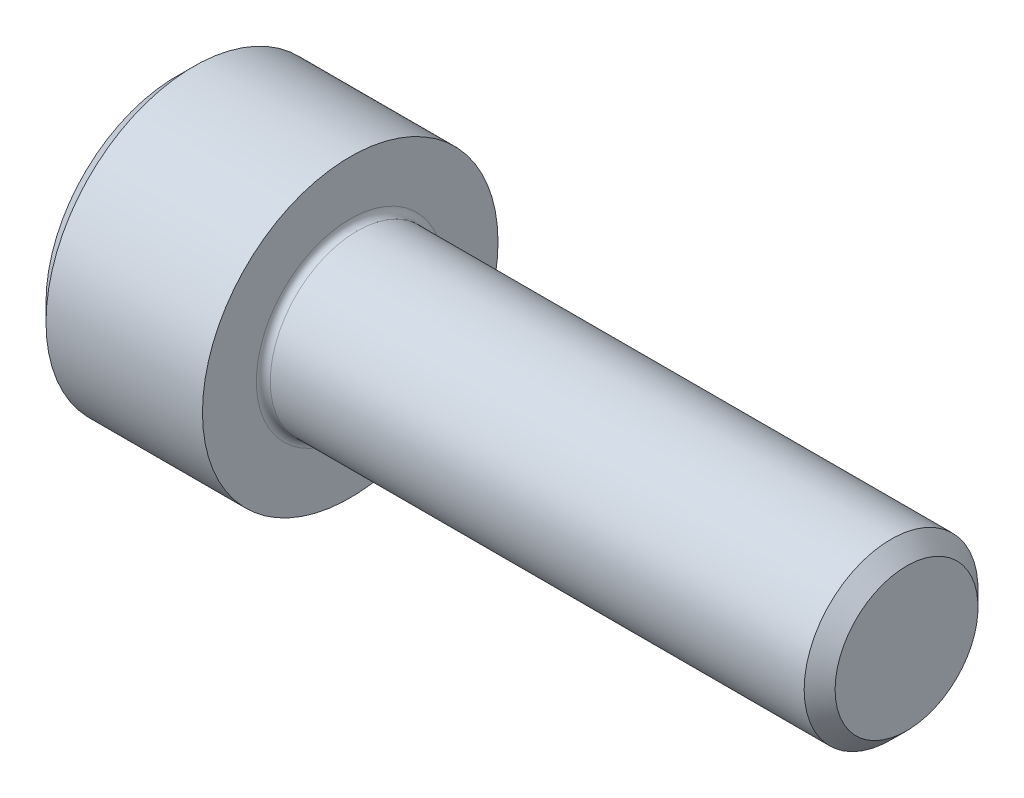
ISO-10303-21;
HEADER;
FILE_DESCRIPTION(('STEP AP214'),'2;1');
FILE_NAME('part.step','',(''),(''),'','','');
FILE_SCHEMA(('AUTOMOTIVE_DESIGN { 1 0 10303 214 1 1 1 1 }'));
ENDSEC;
DATA;
#1=APPLICATION_CONTEXT('core data for automotive mechanical design processes');
#2=APPLICATION_PROTOCOL_DEFINITION('international standard','automotive_design',2000,#1);
#3=PRODUCT_CONTEXT('',#1,'mechanical');
#4=PRODUCT('Part','Part','',(#3));
#5=PRODUCT_RELATED_PRODUCT_CATEGORY('part','',(#4));
#6=PRODUCT_DEFINITION_FORMATION('','',#4);
#7=PRODUCT_DEFINITION_CONTEXT('part definition',#1,'design');
#8=PRODUCT_DEFINITION('design','',#6,#7);
#9=PRODUCT_DEFINITION_SHAPE('','',#8);
#10=(LENGTH_UNIT() NAMED_UNIT(*) SI_UNIT(.MILLI.,.METRE.));
#11=(NAMED_UNIT(*) PLANE_ANGLE_UNIT() SI_UNIT($,.RADIAN.));
#12=(NAMED_UNIT(*) SI_UNIT($,.STERADIAN.) SOLID_ANGLE_UNIT());
#13=UNCERTAINTY_MEASURE_WITH_UNIT(LENGTH_MEASURE(1.E-05),#10,'distance_accuracy_value','');
#14=(GEOMETRIC_REPRESENTATION_CONTEXT(3) GLOBAL_UNCERTAINTY_ASSIGNED_CONTEXT((#13)) GLOBAL_UNIT_ASSIGNED_CONTEXT((#10,
#11,#12)) REPRESENTATION_CONTEXT('',''));
#15=CARTESIAN_POINT('',(0.,0.,0.));
#16=DIRECTION('',(0.,0.,1.));
#17=DIRECTION('',(1.,0.,0.));
#18=AXIS2_PLACEMENT_3D('',#15,#16,#17);
#19=CARTESIAN_POINT('',(0.,0.,0.));
#20=DIRECTION('',(-1.,0.,0.));
#21=DIRECTION('',(0.,0.,1.));
#22=AXIS2_PLACEMENT_3D('',#19,#20,#21);
#23=PLANE('',#22);
#24=DIRECTION('',(0.,-0.5,0.866025403784438));
#25=VECTOR('',#24,1.);
#26=CARTESIAN_POINT('',(0.,2.35789849937043,0.));
#27=LINE('',#26,#25);
#28=CARTESIAN_POINT('',(0.,2.35789849937043,0.));
#29=VERTEX_POINT('',#28);
#30=CARTESIAN_POINT('',(0.,1.17894924968521,2.042));
#31=VERTEX_POINT('',#30);
#32=EDGE_CURVE('E386',#29,#31,#27,.T.);
#33=ORIENTED_EDGE('',*,*,#32,.T.);
#34=DIRECTION('',(0.,1.,0.));
#35=VECTOR('',#34,1.);
#36=CARTESIAN_POINT('',(0.,-1.17894924968522,2.042));
#37=LINE('',#36,#35);
#38=CARTESIAN_POINT('',(0.,-1.17894924968522,2.042));
#39=VERTEX_POINT('',#38);
#40=EDGE_CURVE('E130',#39,#31,#37,.T.);
#41=ORIENTED_EDGE('',*,*,#40,.F.);
#42=DIRECTION('',(0.,-0.500000000000001,-0.866025403784438));
#43=VECTOR('',#42,1.);
#44=CARTESIAN_POINT('',(0.,-1.17894924968522,2.042));
#45=LINE('',#44,#43);
#46=CARTESIAN_POINT('',(0.,-2.35789849937044,0.));
#47=VERTEX_POINT('',#46);
#48=EDGE_CURVE('E389',#39,#47,#45,.T.);
#49=ORIENTED_EDGE('',*,*,#48,.T.);
#50=DIRECTION('',(0.,0.5,-0.866025403784439));
#51=VECTOR('',#50,1.);
#52=CARTESIAN_POINT('',(0.,-2.35789849937044,0.));
#53=LINE('',#52,#51);
#54=CARTESIAN_POINT('',(0.,-1.17894924968522,-2.042));
#55=VERTEX_POINT('',#54);
#56=EDGE_CURVE('E392',#47,#55,#53,.T.);
#57=ORIENTED_EDGE('',*,*,#56,.T.);
#58=DIRECTION('',(0.,-1.,0.));
#59=VECTOR('',#58,1.);
#60=CARTESIAN_POINT('',(0.,1.17894924968521,-2.042));
#61=LINE('',#60,#59);
#62=CARTESIAN_POINT('',(0.,1.17894924968521,-2.042));
#63=VERTEX_POINT('',#62);
#64=EDGE_CURVE('E395',#63,#55,#61,.T.);
#65=ORIENTED_EDGE('',*,*,#64,.F.);
#66=DIRECTION('',(0.,-0.500000000000001,-0.866025403784438));
#67=VECTOR('',#66,1.);
#68=CARTESIAN_POINT('',(0.,2.35789849937043,0.));
#69=LINE('',#68,#67);
#70=EDGE_CURVE('E125',#29,#63,#69,.T.);
#71=ORIENTED_EDGE('',*,*,#70,.F.);
#72=EDGE_LOOP('',(#33,#41,#49,#57,#65,#71));
#73=FACE_BOUND('',#72,.T.);
#74=CARTESIAN_POINT('',(0.,0.,0.));
#75=DIRECTION('',(-1.,0.,0.));
#76=DIRECTION('',(0.,0.,1.));
#77=AXIS2_PLACEMENT_3D('',#74,#75,#76);
#78=CIRCLE('',#77,3.75);
#79=CARTESIAN_POINT('',(0.,0.,3.75));
#80=VERTEX_POINT('',#79);
#81=EDGE_CURVE('E141',#80,#80,#78,.T.);
#82=ORIENTED_EDGE('',*,*,#81,.T.);
#83=EDGE_LOOP('',(#82));
#84=FACE_BOUND('',#83,.T.);
#85=ADVANCED_FACE('F34',(#73,#84),#23,.T.);
#86=CARTESIAN_POINT('',(21.,2.055,0.));
#87=DIRECTION('',(1.,0.,0.));
#88=DIRECTION('',(0.,0.,-1.));
#89=AXIS2_PLACEMENT_3D('',#86,#87,#88);
#90=PLANE('',#89);
#91=CARTESIAN_POINT('',(21.,0.,0.));
#92=DIRECTION('',(-1.,0.,0.));
#93=DIRECTION('',(0.,0.,1.));
#94=AXIS2_PLACEMENT_3D('',#91,#92,#93);
#95=CIRCLE('',#94,2.055);
#96=CARTESIAN_POINT('',(21.,0.,2.055));
#97=VERTEX_POINT('',#96);
#98=EDGE_CURVE('E154',#97,#97,#95,.T.);
#99=ORIENTED_EDGE('',*,*,#98,.F.);
#100=EDGE_LOOP('',(#99));
#101=FACE_BOUND('',#100,.T.);
#102=ADVANCED_FACE('F175',(#101),#90,.T.);
#103=CARTESIAN_POINT('',(21.,0.,0.));
#104=DIRECTION('',(-1.,0.,0.));
#105=DIRECTION('',(0.,0.,1.));
#106=AXIS2_PLACEMENT_3D('',#103,#104,#105);
#107=CONICAL_SURFACE('',#106,2.055,0.785398163397382);
#108=CARTESIAN_POINT('',(20.555,0.,0.));
#109=DIRECTION('',(-1.,0.,0.));
#110=DIRECTION('',(0.,0.,1.));
#111=AXIS2_PLACEMENT_3D('',#108,#109,#110);
#112=CIRCLE('',#111,2.49999999999996);
#113=CARTESIAN_POINT('',(20.555,0.,2.49999999999996));
#114=VERTEX_POINT('',#113);
#115=EDGE_CURVE('E151',#114,#114,#112,.T.);
#116=ORIENTED_EDGE('',*,*,#115,.F.);
#117=EDGE_LOOP('',(#116));
#118=FACE_BOUND('',#117,.T.);
#119=ORIENTED_EDGE('',*,*,#98,.T.);
#120=EDGE_LOOP('',(#119));
#121=FACE_BOUND('',#120,.T.);
#122=ADVANCED_FACE('F181',(#118,#121),#107,.T.);
#123=CARTESIAN_POINT('',(-31.75,0.,0.));
#124=DIRECTION('',(-1.,0.,0.));
#125=DIRECTION('',(0.,0.,1.));
#126=AXIS2_PLACEMENT_3D('',#123,#124,#125);
#127=CYLINDRICAL_SURFACE('',#126,2.49999999999998);
#128=CARTESIAN_POINT('',(5.2,0.,0.));
#129=DIRECTION('',(1.,0.,0.));
#130=DIRECTION('',(0.,0.,-1.));
#131=AXIS2_PLACEMENT_3D('',#128,#129,#130);
#132=CIRCLE('',#131,2.49999999999998);
#133=CARTESIAN_POINT('',(5.2,0.,-2.49999999999998));
#134=VERTEX_POINT('',#133);
#135=EDGE_CURVE('E11',#134,#134,#132,.T.);
#136=ORIENTED_EDGE('',*,*,#135,.T.);
#137=EDGE_LOOP('',(#136));
#138=FACE_BOUND('',#137,.T.);
#139=ORIENTED_EDGE('',*,*,#115,.T.);
#140=EDGE_LOOP('',(#139));
#141=FACE_BOUND('',#140,.T.);
#142=ADVANCED_FACE('F192',(#138,#141),#127,.T.);
#143=CARTESIAN_POINT('',(5.,4.25,0.));
#144=DIRECTION('',(1.,0.,0.));
#145=DIRECTION('',(0.,0.,-1.));
#146=AXIS2_PLACEMENT_3D('',#143,#144,#145);
#147=PLANE('',#146);
#148=CARTESIAN_POINT('',(5.,0.,0.));
#149=DIRECTION('',(1.,0.,0.));
#150=DIRECTION('',(0.,0.,-1.));
#151=AXIS2_PLACEMENT_3D('',#148,#149,#150);
#152=CIRCLE('',#151,2.69999999999998);
#153=CARTESIAN_POINT('',(5.,0.,-2.69999999999998));
#154=VERTEX_POINT('',#153);
#155=EDGE_CURVE('E42',#154,#154,#152,.F.);
#156=ORIENTED_EDGE('',*,*,#155,.T.);
#157=EDGE_LOOP('',(#156));
#158=FACE_BOUND('',#157,.T.);
#159=CARTESIAN_POINT('',(5.,0.,0.));
#160=DIRECTION('',(-1.,0.,0.));
#161=DIRECTION('',(0.,0.,1.));
#162=AXIS2_PLACEMENT_3D('',#159,#160,#161);
#163=CIRCLE('',#162,4.25);
#164=CARTESIAN_POINT('',(5.,0.,4.25));
#165=VERTEX_POINT('',#164);
#166=EDGE_CURVE('E148',#165,#165,#163,.T.);
#167=ORIENTED_EDGE('',*,*,#166,.F.);
#168=EDGE_LOOP('',(#167));
#169=FACE_BOUND('',#168,.T.);
#170=ADVANCED_FACE('F159',(#158,#169),#147,.T.);
#171=CARTESIAN_POINT('',(-31.75,0.,0.));
#172=DIRECTION('',(-1.,0.,0.));
#173=DIRECTION('',(0.,0.,1.));
#174=AXIS2_PLACEMENT_3D('',#171,#172,#173);
#175=CYLINDRICAL_SURFACE('',#174,4.25);
#176=ORIENTED_EDGE('',*,*,#166,.T.);
#177=EDGE_LOOP('',(#176));
#178=FACE_BOUND('',#177,.T.);
#179=CARTESIAN_POINT('',(0.5,0.,0.));
#180=DIRECTION('',(-1.,0.,0.));
#181=DIRECTION('',(0.,0.,1.));
#182=AXIS2_PLACEMENT_3D('',#179,#180,#181);
#183=CIRCLE('',#182,4.25);
#184=CARTESIAN_POINT('',(0.5,0.,4.25));
#185=VERTEX_POINT('',#184);
#186=EDGE_CURVE('E145',#185,#185,#183,.T.);
#187=ORIENTED_EDGE('',*,*,#186,.F.);
#188=EDGE_LOOP('',(#187));
#189=FACE_BOUND('',#188,.T.);
#190=ADVANCED_FACE('F170',(#178,#189),#175,.T.);
#191=CARTESIAN_POINT('',(0.,0.,0.));
#192=DIRECTION('',(1.,0.,0.));
#193=DIRECTION('',(0.,0.,-1.));
#194=AXIS2_PLACEMENT_3D('',#191,#192,#193);
#195=CONICAL_SURFACE('',#194,3.75,0.785398163397449);
#196=ORIENTED_EDGE('',*,*,#186,.T.);
#197=EDGE_LOOP('',(#196));
#198=FACE_BOUND('',#197,.T.);
#199=ORIENTED_EDGE('',*,*,#81,.F.);
#200=EDGE_LOOP('',(#199));
#201=FACE_BOUND('',#200,.T.);
#202=ADVANCED_FACE('F163',(#198,#201),#195,.T.);
#203=CARTESIAN_POINT('',(5.2,0.,0.));
#204=DIRECTION('',(1.,0.,0.));
#205=DIRECTION('',(0.,0.,-1.));
#206=AXIS2_PLACEMENT_3D('',#203,#204,#205);
#207=TOROIDAL_SURFACE('',#206,2.69999999999998,0.2);
#208=ORIENTED_EDGE('',*,*,#135,.F.);
#209=EDGE_LOOP('',(#208));
#210=FACE_BOUND('',#209,.T.);
#211=ORIENTED_EDGE('',*,*,#155,.F.);
#212=EDGE_LOOP('',(#211));
#213=FACE_BOUND('',#212,.T.);
#214=ADVANCED_FACE('F36',(#210,#213),#207,.F.);
#215=CARTESIAN_POINT('',(2.5,2.35789849937043,0.));
#216=DIRECTION('',(0.,-0.866025403784439,-0.5));
#217=DIRECTION('',(0.,0.5,-0.866025403784439));
#218=AXIS2_PLACEMENT_3D('',#215,#216,#217);
#219=PLANE('',#218);
#220=ORIENTED_EDGE('',*,*,#32,.F.);
#221=DIRECTION('',(-1.,0.,0.));
#222=VECTOR('',#221,1.);
#223=CARTESIAN_POINT('',(2.5,2.35789849937043,0.));
#224=LINE('',#223,#222);
#225=CARTESIAN_POINT('',(2.5,2.35789849937043,0.));
#226=VERTEX_POINT('',#225);
#227=EDGE_CURVE('E376',#226,#29,#224,.T.);
#228=ORIENTED_EDGE('',*,*,#227,.F.);
#229=DIRECTION('',(0.,-0.5,0.866025403784438));
#230=VECTOR('',#229,1.);
#231=CARTESIAN_POINT('',(2.5,2.35789849937043,0.));
#232=LINE('',#231,#230);
#233=CARTESIAN_POINT('',(2.5,1.76842387452782,1.021));
#234=VERTEX_POINT('',#233);
#235=EDGE_CURVE('E117',#226,#234,#232,.T.);
#236=ORIENTED_EDGE('',*,*,#235,.T.);
#237=CARTESIAN_POINT('',(2.5,1.17894924968521,2.042));
#238=VERTEX_POINT('',#237);
#239=EDGE_CURVE('E108',#234,#238,#232,.T.);
#240=ORIENTED_EDGE('',*,*,#239,.T.);
#241=DIRECTION('',(-1.,0.,0.));
#242=VECTOR('',#241,1.);
#243=CARTESIAN_POINT('',(2.5,1.17894924968521,2.042));
#244=LINE('',#243,#242);
#245=EDGE_CURVE('E122',#238,#31,#244,.T.);
#246=ORIENTED_EDGE('',*,*,#245,.T.);
#247=EDGE_LOOP('',(#220,#228,#236,#240,#246));
#248=FACE_BOUND('',#247,.T.);
#249=ADVANCED_FACE('F121',(#248),#219,.T.);
#250=CARTESIAN_POINT('',(2.5,-1.17894924968522,2.042));
#251=DIRECTION('',(0.,0.,1.));
#252=DIRECTION('',(0.,-1.,0.));
#253=AXIS2_PLACEMENT_3D('',#250,#251,#252);
#254=PLANE('',#253);
#255=ORIENTED_EDGE('',*,*,#40,.T.);
#256=ORIENTED_EDGE('',*,*,#245,.F.);
#257=DIRECTION('',(0.,1.,0.));
#258=VECTOR('',#257,1.);
#259=CARTESIAN_POINT('',(2.5,-1.17894924968522,2.042));
#260=LINE('',#259,#258);
#261=CARTESIAN_POINT('',(2.5,0.,2.042));
#262=VERTEX_POINT('',#261);
#263=EDGE_CURVE('E105',#262,#238,#260,.T.);
#264=ORIENTED_EDGE('',*,*,#263,.F.);
#265=CARTESIAN_POINT('',(2.5,-1.17894924968522,2.042));
#266=VERTEX_POINT('',#265);
#267=EDGE_CURVE('E116',#266,#262,#260,.T.);
#268=ORIENTED_EDGE('',*,*,#267,.F.);
#269=DIRECTION('',(-1.,0.,0.));
#270=VECTOR('',#269,1.);
#271=CARTESIAN_POINT('',(2.5,-1.17894924968522,2.042));
#272=LINE('',#271,#270);
#273=EDGE_CURVE('E132',#266,#39,#272,.T.);
#274=ORIENTED_EDGE('',*,*,#273,.T.);
#275=EDGE_LOOP('',(#255,#256,#264,#268,#274));
#276=FACE_BOUND('',#275,.T.);
#277=ADVANCED_FACE('F127',(#276),#254,.F.);
#278=CARTESIAN_POINT('',(2.5,-1.17894924968522,2.042));
#279=DIRECTION('',(0.,0.866025403784438,-0.500000000000001));
#280=DIRECTION('',(0.,0.500000000000001,0.866025403784438));
#281=AXIS2_PLACEMENT_3D('',#278,#279,#280);
#282=PLANE('',#281);
#283=ORIENTED_EDGE('',*,*,#48,.F.);
#284=ORIENTED_EDGE('',*,*,#273,.F.);
#285=DIRECTION('',(0.,-0.500000000000001,-0.866025403784438));
#286=VECTOR('',#285,1.);
#287=CARTESIAN_POINT('',(2.5,-1.17894924968522,2.042));
#288=LINE('',#287,#286);
#289=CARTESIAN_POINT('',(2.5,-1.76842387452782,1.021));
#290=VERTEX_POINT('',#289);
#291=EDGE_CURVE('E415',#266,#290,#288,.T.);
#292=ORIENTED_EDGE('',*,*,#291,.T.);
#293=CARTESIAN_POINT('',(2.5,-2.35789849937044,0.));
#294=VERTEX_POINT('',#293);
#295=EDGE_CURVE('E404',#290,#294,#288,.T.);
#296=ORIENTED_EDGE('',*,*,#295,.T.);
#297=DIRECTION('',(-1.,0.,0.));
#298=VECTOR('',#297,1.);
#299=CARTESIAN_POINT('',(2.5,-2.35789849937044,0.));
#300=LINE('',#299,#298);
#301=EDGE_CURVE('E137',#294,#47,#300,.T.);
#302=ORIENTED_EDGE('',*,*,#301,.T.);
#303=EDGE_LOOP('',(#283,#284,#292,#296,#302));
#304=FACE_BOUND('',#303,.T.);
#305=ADVANCED_FACE('F267',(#304),#282,.T.);
#306=CARTESIAN_POINT('',(2.5,-2.35789849937044,0.));
#307=DIRECTION('',(0.,0.866025403784439,0.5));
#308=DIRECTION('',(0.,-0.5,0.866025403784439));
#309=AXIS2_PLACEMENT_3D('',#306,#307,#308);
#310=PLANE('',#309);
#311=ORIENTED_EDGE('',*,*,#56,.F.);
#312=ORIENTED_EDGE('',*,*,#301,.F.);
#313=DIRECTION('',(0.,0.5,-0.866025403784439));
#314=VECTOR('',#313,1.);
#315=CARTESIAN_POINT('',(2.5,-2.35789849937044,0.));
#316=LINE('',#315,#314);
#317=CARTESIAN_POINT('',(2.5,-1.76842387452783,-1.021));
#318=VERTEX_POINT('',#317);
#319=EDGE_CURVE('E382',#294,#318,#316,.T.);
#320=ORIENTED_EDGE('',*,*,#319,.T.);
#321=CARTESIAN_POINT('',(2.5,-1.17894924968522,-2.042));
#322=VERTEX_POINT('',#321);
#323=EDGE_CURVE('E414',#318,#322,#316,.T.);
#324=ORIENTED_EDGE('',*,*,#323,.T.);
#325=DIRECTION('',(-1.,0.,0.));
#326=VECTOR('',#325,1.);
#327=CARTESIAN_POINT('',(2.5,-1.17894924968522,-2.042));
#328=LINE('',#327,#326);
#329=EDGE_CURVE('E375',#322,#55,#328,.T.);
#330=ORIENTED_EDGE('',*,*,#329,.T.);
#331=EDGE_LOOP('',(#311,#312,#320,#324,#330));
#332=FACE_BOUND('',#331,.T.);
#333=ADVANCED_FACE('F275',(#332),#310,.T.);
#334=CARTESIAN_POINT('',(2.5,1.17894924968521,-2.042));
#335=DIRECTION('',(0.,0.,-1.));
#336=DIRECTION('',(0.,1.,0.));
#337=AXIS2_PLACEMENT_3D('',#334,#335,#336);
#338=PLANE('',#337);
#339=ORIENTED_EDGE('',*,*,#64,.T.);
#340=ORIENTED_EDGE('',*,*,#329,.F.);
#341=DIRECTION('',(0.,-1.,0.));
#342=VECTOR('',#341,1.);
#343=CARTESIAN_POINT('',(2.5,1.17894924968521,-2.042));
#344=LINE('',#343,#342);
#345=CARTESIAN_POINT('',(2.5,0.,-2.042));
#346=VERTEX_POINT('',#345);
#347=EDGE_CURVE('E379',#346,#322,#344,.T.);
#348=ORIENTED_EDGE('',*,*,#347,.F.);
#349=CARTESIAN_POINT('',(2.5,1.17894924968521,-2.042));
#350=VERTEX_POINT('',#349);
#351=EDGE_CURVE('E49',#350,#346,#344,.T.);
#352=ORIENTED_EDGE('',*,*,#351,.F.);
#353=DIRECTION('',(-1.,0.,0.));
#354=VECTOR('',#353,1.);
#355=CARTESIAN_POINT('',(2.5,1.17894924968521,-2.042));
#356=LINE('',#355,#354);
#357=EDGE_CURVE('E372',#350,#63,#356,.T.);
#358=ORIENTED_EDGE('',*,*,#357,.T.);
#359=EDGE_LOOP('',(#339,#340,#348,#352,#358));
#360=FACE_BOUND('',#359,.T.);
#361=ADVANCED_FACE('F284',(#360),#338,.F.);
#362=CARTESIAN_POINT('',(2.5,2.35789849937043,0.));
#363=DIRECTION('',(0.,0.866025403784438,-0.500000000000001));
#364=DIRECTION('',(0.,0.500000000000001,0.866025403784438));
#365=AXIS2_PLACEMENT_3D('',#362,#363,#364);
#366=PLANE('',#365);
#367=ORIENTED_EDGE('',*,*,#70,.T.);
#368=ORIENTED_EDGE('',*,*,#357,.F.);
#369=DIRECTION('',(0.,-0.500000000000001,-0.866025403784438));
#370=VECTOR('',#369,1.);
#371=CARTESIAN_POINT('',(2.5,2.35789849937043,0.));
#372=LINE('',#371,#370);
#373=CARTESIAN_POINT('',(2.5,1.76842387452782,-1.021));
#374=VERTEX_POINT('',#373);
#375=EDGE_CURVE('E362',#374,#350,#372,.T.);
#376=ORIENTED_EDGE('',*,*,#375,.F.);
#377=EDGE_CURVE('E368',#226,#374,#372,.T.);
#378=ORIENTED_EDGE('',*,*,#377,.F.);
#379=ORIENTED_EDGE('',*,*,#227,.T.);
#380=EDGE_LOOP('',(#367,#368,#376,#378,#379));
#381=FACE_BOUND('',#380,.T.);
#382=ADVANCED_FACE('F293',(#381),#366,.F.);
#383=CARTESIAN_POINT('',(2.5,2.35789849937043,0.));
#384=DIRECTION('',(1.,0.,0.));
#385=DIRECTION('',(0.,0.,-1.));
#386=AXIS2_PLACEMENT_3D('',#383,#384,#385);
#387=PLANE('',#386);
#388=ORIENTED_EDGE('',*,*,#347,.T.);
#389=ORIENTED_EDGE('',*,*,#323,.F.);
#390=CARTESIAN_POINT('',(2.5,0.,0.));
#391=DIRECTION('',(-1.,0.,0.));
#392=DIRECTION('',(0.,0.,1.));
#393=AXIS2_PLACEMENT_3D('',#390,#391,#392);
#394=CIRCLE('',#393,2.042);
#395=EDGE_CURVE('E410',#346,#318,#394,.T.);
#396=ORIENTED_EDGE('',*,*,#395,.F.);
#397=EDGE_LOOP('',(#388,#389,#396));
#398=FACE_BOUND('',#397,.T.);
#399=ADVANCED_FACE('F302',(#398),#387,.F.);
#400=ORIENTED_EDGE('',*,*,#319,.F.);
#401=ORIENTED_EDGE('',*,*,#295,.F.);
#402=EDGE_CURVE('E135',#318,#290,#394,.T.);
#403=ORIENTED_EDGE('',*,*,#402,.F.);
#404=EDGE_LOOP('',(#400,#401,#403));
#405=FACE_BOUND('',#404,.T.);
#406=ADVANCED_FACE('F311',(#405),#387,.F.);
#407=ORIENTED_EDGE('',*,*,#291,.F.);
#408=ORIENTED_EDGE('',*,*,#267,.T.);
#409=EDGE_CURVE('E131',#290,#262,#394,.T.);
#410=ORIENTED_EDGE('',*,*,#409,.F.);
#411=EDGE_LOOP('',(#407,#408,#410));
#412=FACE_BOUND('',#411,.T.);
#413=ADVANCED_FACE('F320',(#412),#387,.F.);
#414=ORIENTED_EDGE('',*,*,#263,.T.);
#415=ORIENTED_EDGE('',*,*,#239,.F.);
#416=EDGE_CURVE('E111',#262,#234,#394,.T.);
#417=ORIENTED_EDGE('',*,*,#416,.F.);
#418=EDGE_LOOP('',(#414,#415,#417));
#419=FACE_BOUND('',#418,.T.);
#420=ADVANCED_FACE('F107',(#419),#387,.F.);
#421=ORIENTED_EDGE('',*,*,#235,.F.);
#422=ORIENTED_EDGE('',*,*,#377,.T.);
#423=EDGE_CURVE('E142',#234,#374,#394,.T.);
#424=ORIENTED_EDGE('',*,*,#423,.F.);
#425=EDGE_LOOP('',(#421,#422,#424));
#426=FACE_BOUND('',#425,.T.);
#427=ADVANCED_FACE('F335',(#426),#387,.F.);
#428=ORIENTED_EDGE('',*,*,#375,.T.);
#429=ORIENTED_EDGE('',*,*,#351,.T.);
#430=EDGE_CURVE('E365',#374,#346,#394,.T.);
#431=ORIENTED_EDGE('',*,*,#430,.F.);
#432=EDGE_LOOP('',(#428,#429,#431));
#433=FACE_BOUND('',#432,.T.);
#434=ADVANCED_FACE('F250',(#433),#387,.F.);
#435=CARTESIAN_POINT('',(2.5,0.,0.));
#436=DIRECTION('',(-1.,0.,0.));
#437=DIRECTION('',(0.,0.,1.));
#438=AXIS2_PLACEMENT_3D('',#435,#436,#437);
#439=CONICAL_SURFACE('',#438,2.042,1.04719755119659);
#440=CARTESIAN_POINT('',(3.67894924968522,0.,0.));
#441=VERTEX_POINT('',#440);
#442=VERTEX_LOOP('',#441);
#443=FACE_BOUND('',#442,.T.);
#444=ORIENTED_EDGE('',*,*,#416,.T.);
#445=ORIENTED_EDGE('',*,*,#423,.T.);
#446=ORIENTED_EDGE('',*,*,#430,.T.);
#447=ORIENTED_EDGE('',*,*,#395,.T.);
#448=ORIENTED_EDGE('',*,*,#402,.T.);
#449=ORIENTED_EDGE('',*,*,#409,.T.);
#450=EDGE_LOOP('',(#444,#445,#446,#447,#448,#449));
#451=FACE_BOUND('',#450,.T.);
#452=ADVANCED_FACE('F185',(#443,#451),#439,.F.);
#453=CLOSED_SHELL('',(#85,#102,#122,#142,#170,#190,#202,#214,#249,#277,#305,#333,#361,#382,#399,
#406,#413,#420,#427,#434,#452));
#454=MANIFOLD_SOLID_BREP('B2',#453);
#455=ADVANCED_BREP_SHAPE_REPRESENTATION('',(#18,#454),#14);
#456=SHAPE_DEFINITION_REPRESENTATION(#9,#455);
ENDSEC;
END-ISO-10303-21;
